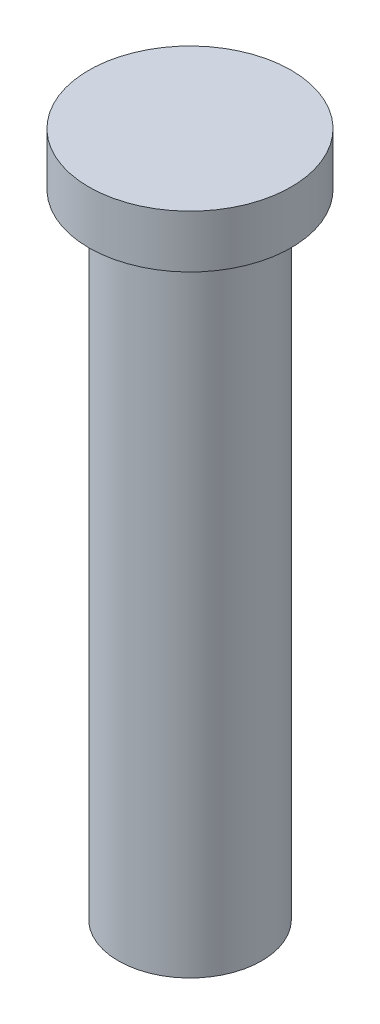
ISO-10303-21;
HEADER;
FILE_DESCRIPTION(('STEP AP214'),'2;1');
FILE_NAME('part.step','',(''),(''),'','','');
FILE_SCHEMA(('AUTOMOTIVE_DESIGN { 1 0 10303 214 1 1 1 1 }'));
ENDSEC;
DATA;
#1=APPLICATION_CONTEXT('core data for automotive mechanical design processes');
#2=APPLICATION_PROTOCOL_DEFINITION('international standard','automotive_design',2000,#1);
#3=PRODUCT_CONTEXT('',#1,'mechanical');
#4=PRODUCT('Part','Part','',(#3));
#5=PRODUCT_RELATED_PRODUCT_CATEGORY('part','',(#4));
#6=PRODUCT_DEFINITION_FORMATION('','',#4);
#7=PRODUCT_DEFINITION_CONTEXT('part definition',#1,'design');
#8=PRODUCT_DEFINITION('design','',#6,#7);
#9=PRODUCT_DEFINITION_SHAPE('','',#8);
#10=(LENGTH_UNIT() NAMED_UNIT(*) SI_UNIT(.MILLI.,.METRE.));
#11=(NAMED_UNIT(*) PLANE_ANGLE_UNIT() SI_UNIT($,.RADIAN.));
#12=(NAMED_UNIT(*) SI_UNIT($,.STERADIAN.) SOLID_ANGLE_UNIT());
#13=UNCERTAINTY_MEASURE_WITH_UNIT(LENGTH_MEASURE(1.E-05),#10,'distance_accuracy_value','');
#14=(GEOMETRIC_REPRESENTATION_CONTEXT(3) GLOBAL_UNCERTAINTY_ASSIGNED_CONTEXT((#13)) GLOBAL_UNIT_ASSIGNED_CONTEXT((#10,
#11,#12)) REPRESENTATION_CONTEXT('',''));
#15=CARTESIAN_POINT('',(0.,0.,0.));
#16=DIRECTION('',(0.,0.,1.));
#17=DIRECTION('',(1.,0.,0.));
#18=AXIS2_PLACEMENT_3D('',#15,#16,#17);
#19=CARTESIAN_POINT('',(0.,15.,0.));
#20=DIRECTION('',(0.,-1.,0.));
#21=DIRECTION('',(0.,0.,-1.));
#22=AXIS2_PLACEMENT_3D('',#19,#20,#21);
#23=CYLINDRICAL_SURFACE('',#22,1.7);
#24=CARTESIAN_POINT('',(0.,15.,0.));
#25=DIRECTION('',(0.,1.,0.));
#26=DIRECTION('',(0.,0.,1.));
#27=AXIS2_PLACEMENT_3D('',#24,#25,#26);
#28=CIRCLE('',#27,1.7);
#29=CARTESIAN_POINT('',(0.,15.,1.7));
#30=VERTEX_POINT('',#29);
#31=EDGE_CURVE('E10',#30,#30,#28,.T.);
#32=ORIENTED_EDGE('',*,*,#31,.F.);
#33=EDGE_LOOP('',(#32));
#34=FACE_BOUND('',#33,.T.);
#35=CARTESIAN_POINT('',(0.,0.,0.));
#36=DIRECTION('',(0.,1.,0.));
#37=DIRECTION('',(0.,0.,1.));
#38=AXIS2_PLACEMENT_3D('',#35,#36,#37);
#39=CIRCLE('',#38,1.7);
#40=CARTESIAN_POINT('',(0.,0.,1.7));
#41=VERTEX_POINT('',#40);
#42=EDGE_CURVE('E33',#41,#41,#39,.T.);
#43=ORIENTED_EDGE('',*,*,#42,.T.);
#44=EDGE_LOOP('',(#43));
#45=FACE_BOUND('',#44,.T.);
#46=ADVANCED_FACE('F30',(#34,#45),#23,.T.);
#47=CARTESIAN_POINT('',(0.,0.,0.));
#48=DIRECTION('',(0.,1.,0.));
#49=DIRECTION('',(0.,0.,1.));
#50=AXIS2_PLACEMENT_3D('',#47,#48,#49);
#51=PLANE('',#50);
#52=ORIENTED_EDGE('',*,*,#42,.F.);
#53=EDGE_LOOP('',(#52));
#54=FACE_BOUND('',#53,.T.);
#55=ADVANCED_FACE('F53',(#54),#51,.F.);
#56=CARTESIAN_POINT('',(0.,16.25,0.));
#57=DIRECTION('',(0.,-1.,0.));
#58=DIRECTION('',(0.,0.,-1.));
#59=AXIS2_PLACEMENT_3D('',#56,#57,#58);
#60=CYLINDRICAL_SURFACE('',#59,2.4);
#61=CARTESIAN_POINT('',(0.,16.25,0.));
#62=DIRECTION('',(0.,1.,0.));
#63=DIRECTION('',(0.,0.,1.));
#64=AXIS2_PLACEMENT_3D('',#61,#62,#63);
#65=CIRCLE('',#64,2.4);
#66=CARTESIAN_POINT('',(0.,16.25,2.4));
#67=VERTEX_POINT('',#66);
#68=EDGE_CURVE('E40',#67,#67,#65,.T.);
#69=ORIENTED_EDGE('',*,*,#68,.F.);
#70=EDGE_LOOP('',(#69));
#71=FACE_BOUND('',#70,.T.);
#72=CARTESIAN_POINT('',(0.,15.,0.));
#73=DIRECTION('',(0.,1.,0.));
#74=DIRECTION('',(0.,0.,1.));
#75=AXIS2_PLACEMENT_3D('',#72,#73,#74);
#76=CIRCLE('',#75,2.4);
#77=CARTESIAN_POINT('',(0.,15.,2.4));
#78=VERTEX_POINT('',#77);
#79=EDGE_CURVE('E42',#78,#78,#76,.T.);
#80=ORIENTED_EDGE('',*,*,#79,.T.);
#81=EDGE_LOOP('',(#80));
#82=FACE_BOUND('',#81,.T.);
#83=ADVANCED_FACE('F50',(#71,#82),#60,.T.);
#84=CARTESIAN_POINT('',(0.,16.25,0.));
#85=DIRECTION('',(0.,1.,0.));
#86=DIRECTION('',(0.,0.,1.));
#87=AXIS2_PLACEMENT_3D('',#84,#85,#86);
#88=PLANE('',#87);
#89=ORIENTED_EDGE('',*,*,#68,.T.);
#90=EDGE_LOOP('',(#89));
#91=FACE_BOUND('',#90,.T.);
#92=ADVANCED_FACE('F48',(#91),#88,.T.);
#93=CARTESIAN_POINT('',(0.,15.,0.));
#94=DIRECTION('',(0.,1.,0.));
#95=DIRECTION('',(0.,0.,1.));
#96=AXIS2_PLACEMENT_3D('',#93,#94,#95);
#97=PLANE('',#96);
#98=ORIENTED_EDGE('',*,*,#31,.T.);
#99=EDGE_LOOP('',(#98));
#100=FACE_BOUND('',#99,.T.);
#101=ORIENTED_EDGE('',*,*,#79,.F.);
#102=EDGE_LOOP('',(#101));
#103=FACE_BOUND('',#102,.T.);
#104=ADVANCED_FACE('F57',(#100,#103),#97,.F.);
#105=CLOSED_SHELL('',(#46,#55,#83,#92,#104));
#106=MANIFOLD_SOLID_BREP('B2',#105);
#107=ADVANCED_BREP_SHAPE_REPRESENTATION('',(#18,#106),#14);
#108=SHAPE_DEFINITION_REPRESENTATION(#9,#107);
ENDSEC;
END-ISO-10303-21;
